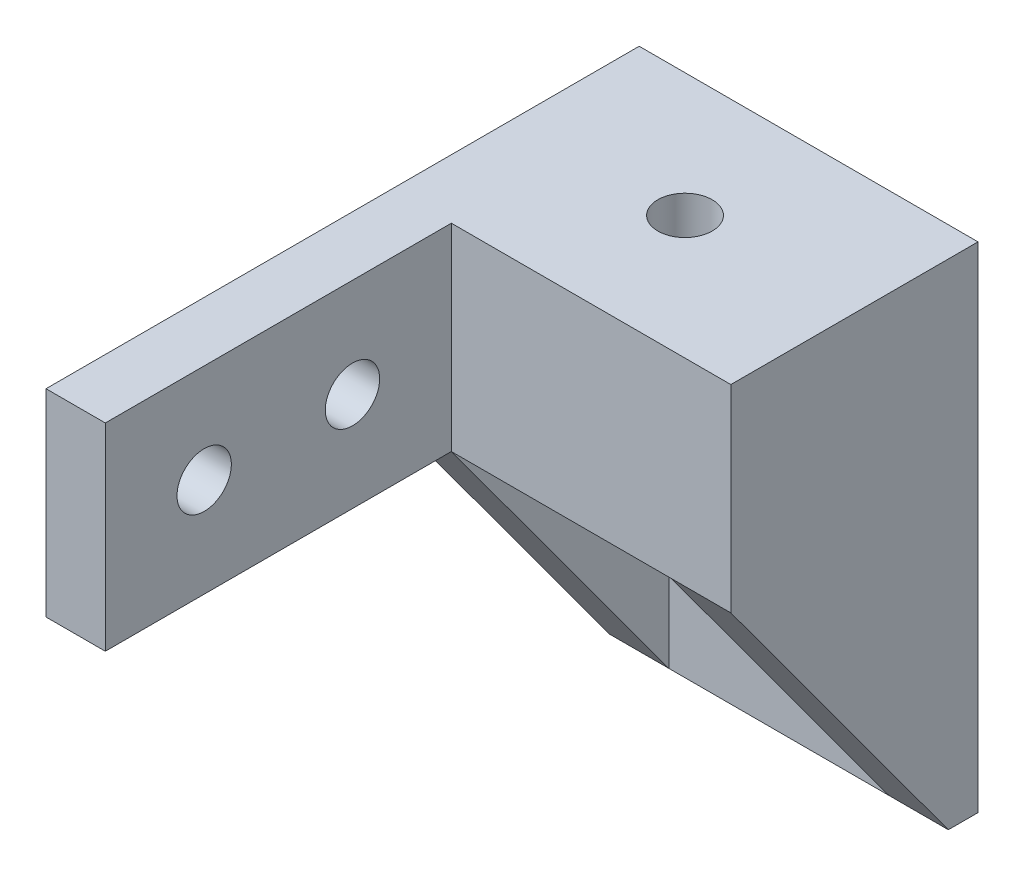
ISO-10303-21;
HEADER;
FILE_DESCRIPTION(('STEP AP214'),'2;1');
FILE_NAME('part.step','',(''),(''),'','','');
FILE_SCHEMA(('AUTOMOTIVE_DESIGN { 1 0 10303 214 1 1 1 1 }'));
ENDSEC;
DATA;
#1=APPLICATION_CONTEXT('core data for automotive mechanical design processes');
#2=APPLICATION_PROTOCOL_DEFINITION('international standard','automotive_design',2000,#1);
#3=PRODUCT_CONTEXT('',#1,'mechanical');
#4=PRODUCT('Part','Part','',(#3));
#5=PRODUCT_RELATED_PRODUCT_CATEGORY('part','',(#4));
#6=PRODUCT_DEFINITION_FORMATION('','',#4);
#7=PRODUCT_DEFINITION_CONTEXT('part definition',#1,'design');
#8=PRODUCT_DEFINITION('design','',#6,#7);
#9=PRODUCT_DEFINITION_SHAPE('','',#8);
#10=(LENGTH_UNIT() NAMED_UNIT(*) SI_UNIT(.MILLI.,.METRE.));
#11=(NAMED_UNIT(*) PLANE_ANGLE_UNIT() SI_UNIT($,.RADIAN.));
#12=(NAMED_UNIT(*) SI_UNIT($,.STERADIAN.) SOLID_ANGLE_UNIT());
#13=UNCERTAINTY_MEASURE_WITH_UNIT(LENGTH_MEASURE(1.E-05),#10,'distance_accuracy_value','');
#14=(GEOMETRIC_REPRESENTATION_CONTEXT(3) GLOBAL_UNCERTAINTY_ASSIGNED_CONTEXT((#13)) GLOBAL_UNIT_ASSIGNED_CONTEXT((#10,
#11,#12)) REPRESENTATION_CONTEXT('',''));
#15=CARTESIAN_POINT('',(0.,0.,0.));
#16=DIRECTION('',(0.,0.,1.));
#17=DIRECTION('',(1.,0.,0.));
#18=AXIS2_PLACEMENT_3D('',#15,#16,#17);
#19=CARTESIAN_POINT('',(35.7360752377383,0.,0.));
#20=DIRECTION('',(0.,-0.591363663627517,0.806404995855705));
#21=DIRECTION('',(0.,-0.806404995855705,-0.591363663627517));
#22=AXIS2_PLACEMENT_3D('',#19,#20,#21);
#23=PLANE('',#22);
#24=DIRECTION('',(0.,-0.806404995855705,-0.591363663627517));
#25=VECTOR('',#24,1.);
#26=CARTESIAN_POINT('',(3.,0.,0.));
#27=LINE('',#26,#25);
#28=CARTESIAN_POINT('',(3.,0.,0.));
#29=VERTEX_POINT('',#28);
#30=CARTESIAN_POINT('',(3.,-15.,-11.));
#31=VERTEX_POINT('',#30);
#32=EDGE_CURVE('E11',#29,#31,#27,.T.);
#33=ORIENTED_EDGE('',*,*,#32,.F.);
#34=DIRECTION('',(1.,0.,0.));
#35=VECTOR('',#34,1.);
#36=CARTESIAN_POINT('',(0.,0.,0.));
#37=LINE('',#36,#35);
#38=CARTESIAN_POINT('',(0.,0.,0.));
#39=VERTEX_POINT('',#38);
#40=EDGE_CURVE('E162',#39,#29,#37,.T.);
#41=ORIENTED_EDGE('',*,*,#40,.F.);
#42=DIRECTION('',(0.,0.806404995855705,0.591363663627517));
#43=VECTOR('',#42,1.);
#44=CARTESIAN_POINT('',(0.,0.,0.));
#45=LINE('',#44,#43);
#46=CARTESIAN_POINT('',(0.,-15.,-11.));
#47=VERTEX_POINT('',#46);
#48=EDGE_CURVE('E184',#47,#39,#45,.T.);
#49=ORIENTED_EDGE('',*,*,#48,.F.);
#50=DIRECTION('',(-1.,0.,0.));
#51=VECTOR('',#50,1.);
#52=CARTESIAN_POINT('',(17.135,-15.,-11.));
#53=LINE('',#52,#51);
#54=EDGE_CURVE('E89',#31,#47,#53,.T.);
#55=ORIENTED_EDGE('',*,*,#54,.F.);
#56=EDGE_LOOP('',(#33,#41,#49,#55));
#57=FACE_BOUND('',#56,.T.);
#58=ADVANCED_FACE('F42',(#57),#23,.T.);
#59=CARTESIAN_POINT('',(0.,5.,0.));
#60=DIRECTION('',(1.,0.,0.));
#61=DIRECTION('',(0.,0.,-1.));
#62=AXIS2_PLACEMENT_3D('',#59,#60,#61);
#63=PLANE('',#62);
#64=ORIENTED_EDGE('',*,*,#48,.T.);
#65=DIRECTION('',(0.,0.,-1.));
#66=VECTOR('',#65,1.);
#67=CARTESIAN_POINT('',(0.,0.,0.));
#68=LINE('',#67,#66);
#69=CARTESIAN_POINT('',(0.,0.,17.5));
#70=VERTEX_POINT('',#69);
#71=EDGE_CURVE('E272',#70,#39,#68,.T.);
#72=ORIENTED_EDGE('',*,*,#71,.F.);
#73=DIRECTION('',(0.,-1.,0.));
#74=VECTOR('',#73,1.);
#75=CARTESIAN_POINT('',(0.,10.,17.5));
#76=LINE('',#75,#74);
#77=CARTESIAN_POINT('',(0.,10.,17.5));
#78=VERTEX_POINT('',#77);
#79=EDGE_CURVE('E269',#78,#70,#76,.T.);
#80=ORIENTED_EDGE('',*,*,#79,.F.);
#81=DIRECTION('',(0.,0.,1.));
#82=VECTOR('',#81,1.);
#83=CARTESIAN_POINT('',(0.,10.,-12.5));
#84=LINE('',#83,#82);
#85=CARTESIAN_POINT('',(0.,10.,-12.5));
#86=VERTEX_POINT('',#85);
#87=EDGE_CURVE('E249',#86,#78,#84,.T.);
#88=ORIENTED_EDGE('',*,*,#87,.F.);
#89=DIRECTION('',(0.,-1.,0.));
#90=VECTOR('',#89,1.);
#91=CARTESIAN_POINT('',(0.,5.,-12.5));
#92=LINE('',#91,#90);
#93=CARTESIAN_POINT('',(0.,-15.,-12.5));
#94=VERTEX_POINT('',#93);
#95=EDGE_CURVE('E203',#86,#94,#92,.T.);
#96=ORIENTED_EDGE('',*,*,#95,.T.);
#97=DIRECTION('',(0.,0.,-1.));
#98=VECTOR('',#97,1.);
#99=CARTESIAN_POINT('',(0.,-15.,-11.));
#100=LINE('',#99,#98);
#101=EDGE_CURVE('E163',#47,#94,#100,.T.);
#102=ORIENTED_EDGE('',*,*,#101,.F.);
#103=EDGE_LOOP('',(#64,#72,#80,#88,#96,#102));
#104=FACE_BOUND('',#103,.T.);
#105=CARTESIAN_POINT('',(0.,5.,5.));
#106=DIRECTION('',(1.,0.,0.));
#107=DIRECTION('',(0.,0.,-1.));
#108=AXIS2_PLACEMENT_3D('',#105,#106,#107);
#109=CIRCLE('',#108,1.375);
#110=CARTESIAN_POINT('',(0.,5.,3.625));
#111=VERTEX_POINT('',#110);
#112=EDGE_CURVE('E286',#111,#111,#109,.T.);
#113=ORIENTED_EDGE('',*,*,#112,.T.);
#114=EDGE_LOOP('',(#113));
#115=FACE_BOUND('',#114,.T.);
#116=CARTESIAN_POINT('',(0.,5.,12.5));
#117=DIRECTION('',(1.,0.,0.));
#118=DIRECTION('',(0.,0.,-1.));
#119=AXIS2_PLACEMENT_3D('',#116,#117,#118);
#120=CIRCLE('',#119,1.375);
#121=CARTESIAN_POINT('',(0.,5.,11.125));
#122=VERTEX_POINT('',#121);
#123=EDGE_CURVE('E294',#122,#122,#120,.T.);
#124=ORIENTED_EDGE('',*,*,#123,.T.);
#125=EDGE_LOOP('',(#124));
#126=FACE_BOUND('',#125,.T.);
#127=ADVANCED_FACE('F44',(#104,#115,#126),#63,.F.);
#128=CARTESIAN_POINT('',(0.,5.,0.));
#129=DIRECTION('',(0.,0.,-1.));
#130=DIRECTION('',(-1.,0.,0.));
#131=AXIS2_PLACEMENT_3D('',#128,#129,#130);
#132=PLANE('',#131);
#133=DIRECTION('',(1.,0.,0.));
#134=VECTOR('',#133,1.);
#135=CARTESIAN_POINT('',(0.,10.,0.));
#136=LINE('',#135,#134);
#137=CARTESIAN_POINT('',(3.,10.,0.));
#138=VERTEX_POINT('',#137);
#139=CARTESIAN_POINT('',(17.135,10.,0.));
#140=VERTEX_POINT('',#139);
#141=EDGE_CURVE('E246',#138,#140,#136,.T.);
#142=ORIENTED_EDGE('',*,*,#141,.F.);
#143=DIRECTION('',(0.,1.,0.));
#144=VECTOR('',#143,1.);
#145=CARTESIAN_POINT('',(3.,10.,0.));
#146=LINE('',#145,#144);
#147=EDGE_CURVE('E59',#29,#138,#146,.T.);
#148=ORIENTED_EDGE('',*,*,#147,.F.);
#149=DIRECTION('',(-1.,0.,0.));
#150=VECTOR('',#149,1.);
#151=CARTESIAN_POINT('',(3.,0.,0.));
#152=LINE('',#151,#150);
#153=CARTESIAN_POINT('',(14.135,0.,0.));
#154=VERTEX_POINT('',#153);
#155=EDGE_CURVE('E141',#154,#29,#152,.T.);
#156=ORIENTED_EDGE('',*,*,#155,.F.);
#157=CARTESIAN_POINT('',(17.135,0.,0.));
#158=VERTEX_POINT('',#157);
#159=EDGE_CURVE('E155',#154,#158,#37,.T.);
#160=ORIENTED_EDGE('',*,*,#159,.T.);
#161=DIRECTION('',(0.,-1.,0.));
#162=VECTOR('',#161,1.);
#163=CARTESIAN_POINT('',(17.135,5.,0.));
#164=LINE('',#163,#162);
#165=EDGE_CURVE('E298',#140,#158,#164,.T.);
#166=ORIENTED_EDGE('',*,*,#165,.F.);
#167=EDGE_LOOP('',(#142,#148,#156,#160,#166));
#168=FACE_BOUND('',#167,.T.);
#169=ADVANCED_FACE('F166',(#168),#132,.F.);
#170=CARTESIAN_POINT('',(17.135,5.,0.));
#171=DIRECTION('',(-1.,0.,0.));
#172=DIRECTION('',(0.,0.,1.));
#173=AXIS2_PLACEMENT_3D('',#170,#171,#172);
#174=PLANE('',#173);
#175=DIRECTION('',(0.,0.,-1.));
#176=VECTOR('',#175,1.);
#177=CARTESIAN_POINT('',(17.135,10.,0.));
#178=LINE('',#177,#176);
#179=CARTESIAN_POINT('',(17.135,10.,-12.5));
#180=VERTEX_POINT('',#179);
#181=EDGE_CURVE('E243',#140,#180,#178,.T.);
#182=ORIENTED_EDGE('',*,*,#181,.F.);
#183=ORIENTED_EDGE('',*,*,#165,.T.);
#184=DIRECTION('',(0.,-0.806404995855705,-0.591363663627517));
#185=VECTOR('',#184,1.);
#186=CARTESIAN_POINT('',(17.135,0.,0.));
#187=LINE('',#186,#185);
#188=CARTESIAN_POINT('',(17.135,-15.,-11.));
#189=VERTEX_POINT('',#188);
#190=EDGE_CURVE('E157',#158,#189,#187,.T.);
#191=ORIENTED_EDGE('',*,*,#190,.T.);
#192=DIRECTION('',(0.,0.,-1.));
#193=VECTOR('',#192,1.);
#194=CARTESIAN_POINT('',(17.135,-15.,-11.));
#195=LINE('',#194,#193);
#196=CARTESIAN_POINT('',(17.135,-15.,-12.5));
#197=VERTEX_POINT('',#196);
#198=EDGE_CURVE('E194',#189,#197,#195,.T.);
#199=ORIENTED_EDGE('',*,*,#198,.T.);
#200=DIRECTION('',(0.,-1.,0.));
#201=VECTOR('',#200,1.);
#202=CARTESIAN_POINT('',(17.135,5.,-12.5));
#203=LINE('',#202,#201);
#204=EDGE_CURVE('E81',#180,#197,#203,.T.);
#205=ORIENTED_EDGE('',*,*,#204,.F.);
#206=EDGE_LOOP('',(#182,#183,#191,#199,#205));
#207=FACE_BOUND('',#206,.T.);
#208=ADVANCED_FACE('F306',(#207),#174,.F.);
#209=CARTESIAN_POINT('',(0.,5.,-12.5));
#210=DIRECTION('',(0.,0.,1.));
#211=DIRECTION('',(1.,0.,0.));
#212=AXIS2_PLACEMENT_3D('',#209,#210,#211);
#213=PLANE('',#212);
#214=CARTESIAN_POINT('',(8.5675,-11.,-12.5));
#215=DIRECTION('',(0.,0.,1.));
#216=DIRECTION('',(1.,0.,0.));
#217=AXIS2_PLACEMENT_3D('',#214,#215,#216);
#218=CIRCLE('',#217,1.375);
#219=CARTESIAN_POINT('',(9.9425,-11.,-12.5));
#220=VERTEX_POINT('',#219);
#221=EDGE_CURVE('E169',#220,#220,#218,.T.);
#222=ORIENTED_EDGE('',*,*,#221,.T.);
#223=EDGE_LOOP('',(#222));
#224=FACE_BOUND('',#223,.T.);
#225=CARTESIAN_POINT('',(8.5675,-4.,-12.5));
#226=DIRECTION('',(0.,0.,1.));
#227=DIRECTION('',(1.,0.,0.));
#228=AXIS2_PLACEMENT_3D('',#225,#226,#227);
#229=CIRCLE('',#228,1.375);
#230=CARTESIAN_POINT('',(9.9425,-4.,-12.5));
#231=VERTEX_POINT('',#230);
#232=EDGE_CURVE('E178',#231,#231,#229,.T.);
#233=ORIENTED_EDGE('',*,*,#232,.T.);
#234=EDGE_LOOP('',(#233));
#235=FACE_BOUND('',#234,.T.);
#236=ORIENTED_EDGE('',*,*,#204,.T.);
#237=DIRECTION('',(-1.,0.,0.));
#238=VECTOR('',#237,1.);
#239=CARTESIAN_POINT('',(17.135,-15.,-12.5));
#240=LINE('',#239,#238);
#241=EDGE_CURVE('E188',#197,#94,#240,.T.);
#242=ORIENTED_EDGE('',*,*,#241,.T.);
#243=ORIENTED_EDGE('',*,*,#95,.F.);
#244=DIRECTION('',(-1.,0.,0.));
#245=VECTOR('',#244,1.);
#246=CARTESIAN_POINT('',(17.135,10.,-12.5));
#247=LINE('',#246,#245);
#248=EDGE_CURVE('E252',#180,#86,#247,.T.);
#249=ORIENTED_EDGE('',*,*,#248,.F.);
#250=EDGE_LOOP('',(#236,#242,#243,#249));
#251=FACE_BOUND('',#250,.T.);
#252=ADVANCED_FACE('F331',(#224,#235,#251),#213,.F.);
#253=CARTESIAN_POINT('',(17.135,-15.,-11.));
#254=DIRECTION('',(0.,-1.,0.));
#255=DIRECTION('',(0.,0.,-1.));
#256=AXIS2_PLACEMENT_3D('',#253,#254,#255);
#257=PLANE('',#256);
#258=ORIENTED_EDGE('',*,*,#241,.F.);
#259=ORIENTED_EDGE('',*,*,#198,.F.);
#260=CARTESIAN_POINT('',(14.135,-15.,-11.));
#261=VERTEX_POINT('',#260);
#262=EDGE_CURVE('E68',#189,#261,#53,.T.);
#263=ORIENTED_EDGE('',*,*,#262,.T.);
#264=DIRECTION('',(1.,0.,0.));
#265=VECTOR('',#264,1.);
#266=CARTESIAN_POINT('',(3.,-15.,-11.));
#267=LINE('',#266,#265);
#268=EDGE_CURVE('E175',#31,#261,#267,.T.);
#269=ORIENTED_EDGE('',*,*,#268,.F.);
#270=ORIENTED_EDGE('',*,*,#54,.T.);
#271=ORIENTED_EDGE('',*,*,#101,.T.);
#272=EDGE_LOOP('',(#258,#259,#263,#269,#270,#271));
#273=FACE_BOUND('',#272,.T.);
#274=ADVANCED_FACE('F330',(#273),#257,.T.);
#275=DIRECTION('',(0.,0.806404995855705,0.591363663627517));
#276=VECTOR('',#275,1.);
#277=CARTESIAN_POINT('',(14.135,0.,0.));
#278=LINE('',#277,#276);
#279=EDGE_CURVE('E52',#261,#154,#278,.T.);
#280=ORIENTED_EDGE('',*,*,#279,.F.);
#281=ORIENTED_EDGE('',*,*,#262,.F.);
#282=ORIENTED_EDGE('',*,*,#190,.F.);
#283=ORIENTED_EDGE('',*,*,#159,.F.);
#284=EDGE_LOOP('',(#280,#281,#282,#283));
#285=FACE_BOUND('',#284,.T.);
#286=ADVANCED_FACE('F156',(#285),#23,.T.);
#287=CARTESIAN_POINT('',(3.,0.,-11.));
#288=DIRECTION('',(-1.,0.,0.));
#289=DIRECTION('',(0.,-1.,0.));
#290=AXIS2_PLACEMENT_3D('',#287,#288,#289);
#291=PLANE('',#290);
#292=ORIENTED_EDGE('',*,*,#32,.T.);
#293=DIRECTION('',(0.,-1.,0.));
#294=VECTOR('',#293,1.);
#295=CARTESIAN_POINT('',(3.,0.,-11.));
#296=LINE('',#295,#294);
#297=CARTESIAN_POINT('',(3.,0.,-11.));
#298=VERTEX_POINT('',#297);
#299=EDGE_CURVE('E168',#298,#31,#296,.T.);
#300=ORIENTED_EDGE('',*,*,#299,.F.);
#301=DIRECTION('',(0.,0.,1.));
#302=VECTOR('',#301,1.);
#303=CARTESIAN_POINT('',(3.,0.,-11.));
#304=LINE('',#303,#302);
#305=EDGE_CURVE('E97',#298,#29,#304,.T.);
#306=ORIENTED_EDGE('',*,*,#305,.T.);
#307=EDGE_LOOP('',(#292,#300,#306));
#308=FACE_BOUND('',#307,.T.);
#309=ADVANCED_FACE('F349',(#308),#291,.F.);
#310=CARTESIAN_POINT('',(3.,0.,-11.));
#311=DIRECTION('',(0.,1.,0.));
#312=DIRECTION('',(0.,0.,1.));
#313=AXIS2_PLACEMENT_3D('',#310,#311,#312);
#314=PLANE('',#313);
#315=CARTESIAN_POINT('',(8.5675,0.,-6.25));
#316=DIRECTION('',(0.,1.,0.));
#317=DIRECTION('',(0.,0.,1.));
#318=AXIS2_PLACEMENT_3D('',#315,#316,#317);
#319=CIRCLE('',#318,1.375);
#320=CARTESIAN_POINT('',(8.5675,0.,-4.875));
#321=VERTEX_POINT('',#320);
#322=EDGE_CURVE('E46',#321,#321,#319,.T.);
#323=ORIENTED_EDGE('',*,*,#322,.T.);
#324=EDGE_LOOP('',(#323));
#325=FACE_BOUND('',#324,.T.);
#326=ORIENTED_EDGE('',*,*,#155,.T.);
#327=ORIENTED_EDGE('',*,*,#305,.F.);
#328=DIRECTION('',(-1.,0.,0.));
#329=VECTOR('',#328,1.);
#330=CARTESIAN_POINT('',(3.,0.,-11.));
#331=LINE('',#330,#329);
#332=CARTESIAN_POINT('',(14.135,0.,-11.));
#333=VERTEX_POINT('',#332);
#334=EDGE_CURVE('E144',#333,#298,#331,.T.);
#335=ORIENTED_EDGE('',*,*,#334,.F.);
#336=DIRECTION('',(0.,0.,1.));
#337=VECTOR('',#336,1.);
#338=CARTESIAN_POINT('',(14.135,0.,-11.));
#339=LINE('',#338,#337);
#340=EDGE_CURVE('E137',#333,#154,#339,.T.);
#341=ORIENTED_EDGE('',*,*,#340,.T.);
#342=EDGE_LOOP('',(#326,#327,#335,#341));
#343=FACE_BOUND('',#342,.T.);
#344=ADVANCED_FACE('F139',(#325,#343),#314,.F.);
#345=CARTESIAN_POINT('',(14.135,0.,-11.));
#346=DIRECTION('',(1.,0.,0.));
#347=DIRECTION('',(0.,1.,0.));
#348=AXIS2_PLACEMENT_3D('',#345,#346,#347);
#349=PLANE('',#348);
#350=ORIENTED_EDGE('',*,*,#279,.T.);
#351=ORIENTED_EDGE('',*,*,#340,.F.);
#352=DIRECTION('',(0.,1.,0.));
#353=VECTOR('',#352,1.);
#354=CARTESIAN_POINT('',(14.135,0.,-11.));
#355=LINE('',#354,#353);
#356=EDGE_CURVE('E151',#261,#333,#355,.T.);
#357=ORIENTED_EDGE('',*,*,#356,.F.);
#358=EDGE_LOOP('',(#350,#351,#357));
#359=FACE_BOUND('',#358,.T.);
#360=ADVANCED_FACE('F150',(#359),#349,.F.);
#361=CARTESIAN_POINT('',(0.,0.,-11.));
#362=DIRECTION('',(0.,0.,1.));
#363=DIRECTION('',(1.,0.,0.));
#364=AXIS2_PLACEMENT_3D('',#361,#362,#363);
#365=PLANE('',#364);
#366=CARTESIAN_POINT('',(8.5675,-11.,-11.));
#367=DIRECTION('',(0.,0.,1.));
#368=DIRECTION('',(1.,0.,0.));
#369=AXIS2_PLACEMENT_3D('',#366,#367,#368);
#370=CIRCLE('',#369,1.375);
#371=CARTESIAN_POINT('',(9.9425,-11.,-11.));
#372=VERTEX_POINT('',#371);
#373=EDGE_CURVE('E235',#372,#372,#370,.T.);
#374=ORIENTED_EDGE('',*,*,#373,.F.);
#375=EDGE_LOOP('',(#374));
#376=FACE_BOUND('',#375,.T.);
#377=CARTESIAN_POINT('',(8.5675,-4.,-11.));
#378=DIRECTION('',(0.,0.,1.));
#379=DIRECTION('',(1.,0.,0.));
#380=AXIS2_PLACEMENT_3D('',#377,#378,#379);
#381=CIRCLE('',#380,1.375);
#382=CARTESIAN_POINT('',(9.9425,-4.,-11.));
#383=VERTEX_POINT('',#382);
#384=EDGE_CURVE('E236',#383,#383,#381,.T.);
#385=ORIENTED_EDGE('',*,*,#384,.F.);
#386=EDGE_LOOP('',(#385));
#387=FACE_BOUND('',#386,.T.);
#388=ORIENTED_EDGE('',*,*,#299,.T.);
#389=ORIENTED_EDGE('',*,*,#268,.T.);
#390=ORIENTED_EDGE('',*,*,#356,.T.);
#391=ORIENTED_EDGE('',*,*,#334,.T.);
#392=EDGE_LOOP('',(#388,#389,#390,#391));
#393=FACE_BOUND('',#392,.T.);
#394=ADVANCED_FACE('F361',(#376,#387,#393),#365,.T.);
#395=CARTESIAN_POINT('',(8.5675,-4.,-13.));
#396=DIRECTION('',(0.,0.,1.));
#397=DIRECTION('',(1.,0.,0.));
#398=AXIS2_PLACEMENT_3D('',#395,#396,#397);
#399=CYLINDRICAL_SURFACE('',#398,1.375);
#400=ORIENTED_EDGE('',*,*,#384,.T.);
#401=EDGE_LOOP('',(#400));
#402=FACE_BOUND('',#401,.T.);
#403=ORIENTED_EDGE('',*,*,#232,.F.);
#404=EDGE_LOOP('',(#403));
#405=FACE_BOUND('',#404,.T.);
#406=ADVANCED_FACE('F365',(#402,#405),#399,.F.);
#407=CARTESIAN_POINT('',(8.5675,-11.,-13.));
#408=DIRECTION('',(0.,0.,1.));
#409=DIRECTION('',(1.,0.,0.));
#410=AXIS2_PLACEMENT_3D('',#407,#408,#409);
#411=CYLINDRICAL_SURFACE('',#410,1.375);
#412=ORIENTED_EDGE('',*,*,#373,.T.);
#413=EDGE_LOOP('',(#412));
#414=FACE_BOUND('',#413,.T.);
#415=ORIENTED_EDGE('',*,*,#221,.F.);
#416=EDGE_LOOP('',(#415));
#417=FACE_BOUND('',#416,.T.);
#418=ADVANCED_FACE('F369',(#414,#417),#411,.F.);
#419=CARTESIAN_POINT('',(8.5675,-0.75,-6.25));
#420=DIRECTION('',(0.,1.,0.));
#421=DIRECTION('',(0.,0.,1.));
#422=AXIS2_PLACEMENT_3D('',#419,#420,#421);
#423=CYLINDRICAL_SURFACE('',#422,1.375);
#424=ORIENTED_EDGE('',*,*,#322,.F.);
#425=EDGE_LOOP('',(#424));
#426=FACE_BOUND('',#425,.T.);
#427=CARTESIAN_POINT('',(8.5675,10.,-6.25));
#428=DIRECTION('',(0.,1.,0.));
#429=DIRECTION('',(0.,0.,1.));
#430=AXIS2_PLACEMENT_3D('',#427,#428,#429);
#431=CIRCLE('',#430,1.375);
#432=CARTESIAN_POINT('',(8.5675,10.,-4.875));
#433=VERTEX_POINT('',#432);
#434=EDGE_CURVE('E256',#433,#433,#431,.T.);
#435=ORIENTED_EDGE('',*,*,#434,.T.);
#436=EDGE_LOOP('',(#435));
#437=FACE_BOUND('',#436,.T.);
#438=ADVANCED_FACE('F373',(#426,#437),#423,.F.);
#439=CARTESIAN_POINT('',(0.,10.,0.));
#440=DIRECTION('',(0.,1.,0.));
#441=DIRECTION('',(0.,0.,1.));
#442=AXIS2_PLACEMENT_3D('',#439,#440,#441);
#443=PLANE('',#442);
#444=ORIENTED_EDGE('',*,*,#141,.T.);
#445=ORIENTED_EDGE('',*,*,#181,.T.);
#446=ORIENTED_EDGE('',*,*,#248,.T.);
#447=ORIENTED_EDGE('',*,*,#87,.T.);
#448=DIRECTION('',(-1.,0.,0.));
#449=VECTOR('',#448,1.);
#450=CARTESIAN_POINT('',(3.,10.,17.5));
#451=LINE('',#450,#449);
#452=CARTESIAN_POINT('',(3.,10.,17.5));
#453=VERTEX_POINT('',#452);
#454=EDGE_CURVE('E260',#453,#78,#451,.T.);
#455=ORIENTED_EDGE('',*,*,#454,.F.);
#456=DIRECTION('',(0.,0.,1.));
#457=VECTOR('',#456,1.);
#458=CARTESIAN_POINT('',(3.,10.,0.));
#459=LINE('',#458,#457);
#460=EDGE_CURVE('E265',#138,#453,#459,.T.);
#461=ORIENTED_EDGE('',*,*,#460,.F.);
#462=EDGE_LOOP('',(#444,#445,#446,#447,#455,#461));
#463=FACE_BOUND('',#462,.T.);
#464=ORIENTED_EDGE('',*,*,#434,.F.);
#465=EDGE_LOOP('',(#464));
#466=FACE_BOUND('',#465,.T.);
#467=ADVANCED_FACE('F309',(#463,#466),#443,.T.);
#468=CARTESIAN_POINT('',(3.,0.,0.));
#469=DIRECTION('',(1.,0.,0.));
#470=DIRECTION('',(0.,0.,1.));
#471=AXIS2_PLACEMENT_3D('',#468,#469,#470);
#472=PLANE('',#471);
#473=CARTESIAN_POINT('',(3.,5.,5.));
#474=DIRECTION('',(1.,0.,0.));
#475=DIRECTION('',(0.,0.,-1.));
#476=AXIS2_PLACEMENT_3D('',#473,#474,#475);
#477=CIRCLE('',#476,1.375);
#478=CARTESIAN_POINT('',(3.,5.,3.625));
#479=VERTEX_POINT('',#478);
#480=EDGE_CURVE('E275',#479,#479,#477,.T.);
#481=ORIENTED_EDGE('',*,*,#480,.F.);
#482=EDGE_LOOP('',(#481));
#483=FACE_BOUND('',#482,.T.);
#484=ORIENTED_EDGE('',*,*,#147,.T.);
#485=ORIENTED_EDGE('',*,*,#460,.T.);
#486=DIRECTION('',(0.,-1.,0.));
#487=VECTOR('',#486,1.);
#488=CARTESIAN_POINT('',(3.,10.,17.5));
#489=LINE('',#488,#487);
#490=CARTESIAN_POINT('',(3.,0.,17.5));
#491=VERTEX_POINT('',#490);
#492=EDGE_CURVE('E278',#453,#491,#489,.T.);
#493=ORIENTED_EDGE('',*,*,#492,.T.);
#494=DIRECTION('',(0.,0.,-1.));
#495=VECTOR('',#494,1.);
#496=CARTESIAN_POINT('',(3.,0.,0.));
#497=LINE('',#496,#495);
#498=EDGE_CURVE('E281',#491,#29,#497,.T.);
#499=ORIENTED_EDGE('',*,*,#498,.T.);
#500=EDGE_LOOP('',(#484,#485,#493,#499));
#501=FACE_BOUND('',#500,.T.);
#502=CARTESIAN_POINT('',(3.,5.,12.5));
#503=DIRECTION('',(1.,0.,0.));
#504=DIRECTION('',(0.,0.,-1.));
#505=AXIS2_PLACEMENT_3D('',#502,#503,#504);
#506=CIRCLE('',#505,1.375);
#507=CARTESIAN_POINT('',(3.,5.,11.125));
#508=VERTEX_POINT('',#507);
#509=EDGE_CURVE('E290',#508,#508,#506,.T.);
#510=ORIENTED_EDGE('',*,*,#509,.F.);
#511=EDGE_LOOP('',(#510));
#512=FACE_BOUND('',#511,.T.);
#513=ADVANCED_FACE('F313',(#483,#501,#512),#472,.T.);
#514=CARTESIAN_POINT('',(3.,10.,17.5));
#515=DIRECTION('',(0.,0.,-1.));
#516=DIRECTION('',(-1.,0.,0.));
#517=AXIS2_PLACEMENT_3D('',#514,#515,#516);
#518=PLANE('',#517);
#519=ORIENTED_EDGE('',*,*,#79,.T.);
#520=DIRECTION('',(-1.,0.,0.));
#521=VECTOR('',#520,1.);
#522=CARTESIAN_POINT('',(3.,0.,17.5));
#523=LINE('',#522,#521);
#524=EDGE_CURVE('E261',#491,#70,#523,.T.);
#525=ORIENTED_EDGE('',*,*,#524,.F.);
#526=ORIENTED_EDGE('',*,*,#492,.F.);
#527=ORIENTED_EDGE('',*,*,#454,.T.);
#528=EDGE_LOOP('',(#519,#525,#526,#527));
#529=FACE_BOUND('',#528,.T.);
#530=ADVANCED_FACE('F318',(#529),#518,.F.);
#531=CARTESIAN_POINT('',(3.,0.,0.));
#532=DIRECTION('',(0.,1.,0.));
#533=DIRECTION('',(0.,0.,1.));
#534=AXIS2_PLACEMENT_3D('',#531,#532,#533);
#535=PLANE('',#534);
#536=ORIENTED_EDGE('',*,*,#71,.T.);
#537=ORIENTED_EDGE('',*,*,#40,.T.);
#538=ORIENTED_EDGE('',*,*,#498,.F.);
#539=ORIENTED_EDGE('',*,*,#524,.T.);
#540=EDGE_LOOP('',(#536,#537,#538,#539));
#541=FACE_BOUND('',#540,.T.);
#542=ADVANCED_FACE('F322',(#541),#535,.F.);
#543=CARTESIAN_POINT('',(3.,5.,5.));
#544=DIRECTION('',(-1.,0.,0.));
#545=DIRECTION('',(0.,0.,1.));
#546=AXIS2_PLACEMENT_3D('',#543,#544,#545);
#547=CYLINDRICAL_SURFACE('',#546,1.375);
#548=ORIENTED_EDGE('',*,*,#480,.T.);
#549=EDGE_LOOP('',(#548));
#550=FACE_BOUND('',#549,.T.);
#551=ORIENTED_EDGE('',*,*,#112,.F.);
#552=EDGE_LOOP('',(#551));
#553=FACE_BOUND('',#552,.T.);
#554=ADVANCED_FACE('F382',(#550,#553),#547,.F.);
#555=CARTESIAN_POINT('',(3.,5.,12.5));
#556=DIRECTION('',(-1.,0.,0.));
#557=DIRECTION('',(0.,0.,1.));
#558=AXIS2_PLACEMENT_3D('',#555,#556,#557);
#559=CYLINDRICAL_SURFACE('',#558,1.375);
#560=ORIENTED_EDGE('',*,*,#509,.T.);
#561=EDGE_LOOP('',(#560));
#562=FACE_BOUND('',#561,.T.);
#563=ORIENTED_EDGE('',*,*,#123,.F.);
#564=EDGE_LOOP('',(#563));
#565=FACE_BOUND('',#564,.T.);
#566=ADVANCED_FACE('F390',(#562,#565),#559,.F.);
#567=CLOSED_SHELL('',(#58,#127,#169,#208,#252,#274,#286,#309,#344,#360,#394,#406,#418,#438,#467,
#513,#530,#542,#554,#566));
#568=MANIFOLD_SOLID_BREP('B2',#567);
#569=ADVANCED_BREP_SHAPE_REPRESENTATION('',(#18,#568),#14);
#570=SHAPE_DEFINITION_REPRESENTATION(#9,#569);
ENDSEC;
END-ISO-10303-21;
